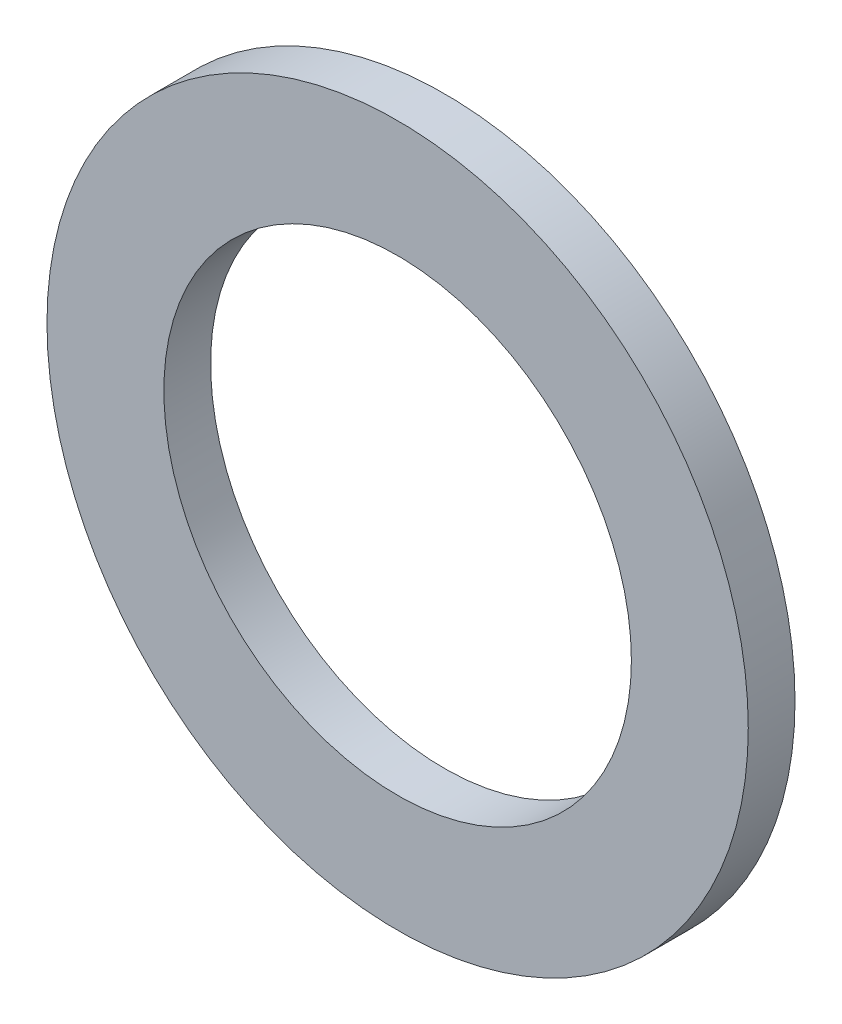
ISO-10303-21;
HEADER;
FILE_DESCRIPTION(('STEP AP214'),'2;1');
FILE_NAME('part.step','',(''),(''),'','','');
FILE_SCHEMA(('AUTOMOTIVE_DESIGN { 1 0 10303 214 1 1 1 1 }'));
ENDSEC;
DATA;
#1=APPLICATION_CONTEXT('core data for automotive mechanical design processes');
#2=APPLICATION_PROTOCOL_DEFINITION('international standard','automotive_design',2000,#1);
#3=PRODUCT_CONTEXT('',#1,'mechanical');
#4=PRODUCT('Part','Part','',(#3));
#5=PRODUCT_RELATED_PRODUCT_CATEGORY('part','',(#4));
#6=PRODUCT_DEFINITION_FORMATION('','',#4);
#7=PRODUCT_DEFINITION_CONTEXT('part definition',#1,'design');
#8=PRODUCT_DEFINITION('design','',#6,#7);
#9=PRODUCT_DEFINITION_SHAPE('','',#8);
#10=(LENGTH_UNIT() NAMED_UNIT(*) SI_UNIT(.MILLI.,.METRE.));
#11=(NAMED_UNIT(*) PLANE_ANGLE_UNIT() SI_UNIT($,.RADIAN.));
#12=(NAMED_UNIT(*) SI_UNIT($,.STERADIAN.) SOLID_ANGLE_UNIT());
#13=UNCERTAINTY_MEASURE_WITH_UNIT(LENGTH_MEASURE(1.E-05),#10,'distance_accuracy_value','');
#14=(GEOMETRIC_REPRESENTATION_CONTEXT(3) GLOBAL_UNCERTAINTY_ASSIGNED_CONTEXT((#13)) GLOBAL_UNIT_ASSIGNED_CONTEXT((#10,
#11,#12)) REPRESENTATION_CONTEXT('',''));
#15=CARTESIAN_POINT('',(0.,0.,0.));
#16=DIRECTION('',(0.,0.,1.));
#17=DIRECTION('',(1.,0.,0.));
#18=AXIS2_PLACEMENT_3D('',#15,#16,#17);
#19=CARTESIAN_POINT('',(0.,0.,1.27));
#20=DIRECTION('',(0.,0.,1.));
#21=DIRECTION('',(1.,0.,0.));
#22=AXIS2_PLACEMENT_3D('',#19,#20,#21);
#23=PLANE('',#22);
#24=CARTESIAN_POINT('',(0.,0.,1.27));
#25=DIRECTION('',(0.,0.,1.));
#26=DIRECTION('',(1.,0.,0.));
#27=AXIS2_PLACEMENT_3D('',#24,#25,#26);
#28=CIRCLE('',#27,9.525);
#29=CARTESIAN_POINT('',(9.525,0.,1.27));
#30=VERTEX_POINT('',#29);
#31=EDGE_CURVE('E10',#30,#30,#28,.T.);
#32=ORIENTED_EDGE('',*,*,#31,.T.);
#33=EDGE_LOOP('',(#32));
#34=FACE_BOUND('',#33,.T.);
#35=CARTESIAN_POINT('',(0.,0.,1.27));
#36=DIRECTION('',(0.,0.,1.));
#37=DIRECTION('',(1.,0.,0.));
#38=AXIS2_PLACEMENT_3D('',#35,#36,#37);
#39=CIRCLE('',#38,6.35);
#40=CARTESIAN_POINT('',(6.35,0.,1.27));
#41=VERTEX_POINT('',#40);
#42=EDGE_CURVE('E41',#41,#41,#39,.T.);
#43=ORIENTED_EDGE('',*,*,#42,.F.);
#44=EDGE_LOOP('',(#43));
#45=FACE_BOUND('',#44,.T.);
#46=ADVANCED_FACE('F30',(#34,#45),#23,.T.);
#47=CARTESIAN_POINT('',(0.,0.,0.));
#48=DIRECTION('',(0.,0.,1.));
#49=DIRECTION('',(1.,0.,0.));
#50=AXIS2_PLACEMENT_3D('',#47,#48,#49);
#51=PLANE('',#50);
#52=CARTESIAN_POINT('',(0.,0.,0.));
#53=DIRECTION('',(0.,0.,1.));
#54=DIRECTION('',(1.,0.,0.));
#55=AXIS2_PLACEMENT_3D('',#52,#53,#54);
#56=CIRCLE('',#55,9.525);
#57=CARTESIAN_POINT('',(9.525,0.,0.));
#58=VERTEX_POINT('',#57);
#59=EDGE_CURVE('E34',#58,#58,#56,.T.);
#60=ORIENTED_EDGE('',*,*,#59,.F.);
#61=EDGE_LOOP('',(#60));
#62=FACE_BOUND('',#61,.T.);
#63=CARTESIAN_POINT('',(0.,0.,0.));
#64=DIRECTION('',(0.,0.,1.));
#65=DIRECTION('',(1.,0.,0.));
#66=AXIS2_PLACEMENT_3D('',#63,#64,#65);
#67=CIRCLE('',#66,6.35);
#68=CARTESIAN_POINT('',(6.35,0.,0.));
#69=VERTEX_POINT('',#68);
#70=EDGE_CURVE('E43',#69,#69,#67,.T.);
#71=ORIENTED_EDGE('',*,*,#70,.T.);
#72=EDGE_LOOP('',(#71));
#73=FACE_BOUND('',#72,.T.);
#74=ADVANCED_FACE('F53',(#62,#73),#51,.F.);
#75=CARTESIAN_POINT('',(0.,0.,1.27));
#76=DIRECTION('',(0.,0.,-1.));
#77=DIRECTION('',(-1.,0.,0.));
#78=AXIS2_PLACEMENT_3D('',#75,#76,#77);
#79=CYLINDRICAL_SURFACE('',#78,9.525);
#80=ORIENTED_EDGE('',*,*,#31,.F.);
#81=EDGE_LOOP('',(#80));
#82=FACE_BOUND('',#81,.T.);
#83=ORIENTED_EDGE('',*,*,#59,.T.);
#84=EDGE_LOOP('',(#83));
#85=FACE_BOUND('',#84,.T.);
#86=ADVANCED_FACE('F32',(#82,#85),#79,.T.);
#87=CARTESIAN_POINT('',(0.,0.,1.27));
#88=DIRECTION('',(0.,0.,-1.));
#89=DIRECTION('',(-1.,0.,0.));
#90=AXIS2_PLACEMENT_3D('',#87,#88,#89);
#91=CYLINDRICAL_SURFACE('',#90,6.35);
#92=ORIENTED_EDGE('',*,*,#42,.T.);
#93=EDGE_LOOP('',(#92));
#94=FACE_BOUND('',#93,.T.);
#95=ORIENTED_EDGE('',*,*,#70,.F.);
#96=EDGE_LOOP('',(#95));
#97=FACE_BOUND('',#96,.T.);
#98=ADVANCED_FACE('F49',(#94,#97),#91,.F.);
#99=CLOSED_SHELL('',(#46,#74,#86,#98));
#100=MANIFOLD_SOLID_BREP('B2',#99);
#101=ADVANCED_BREP_SHAPE_REPRESENTATION('',(#18,#100),#14);
#102=SHAPE_DEFINITION_REPRESENTATION(#9,#101);
ENDSEC;
END-ISO-10303-21;
